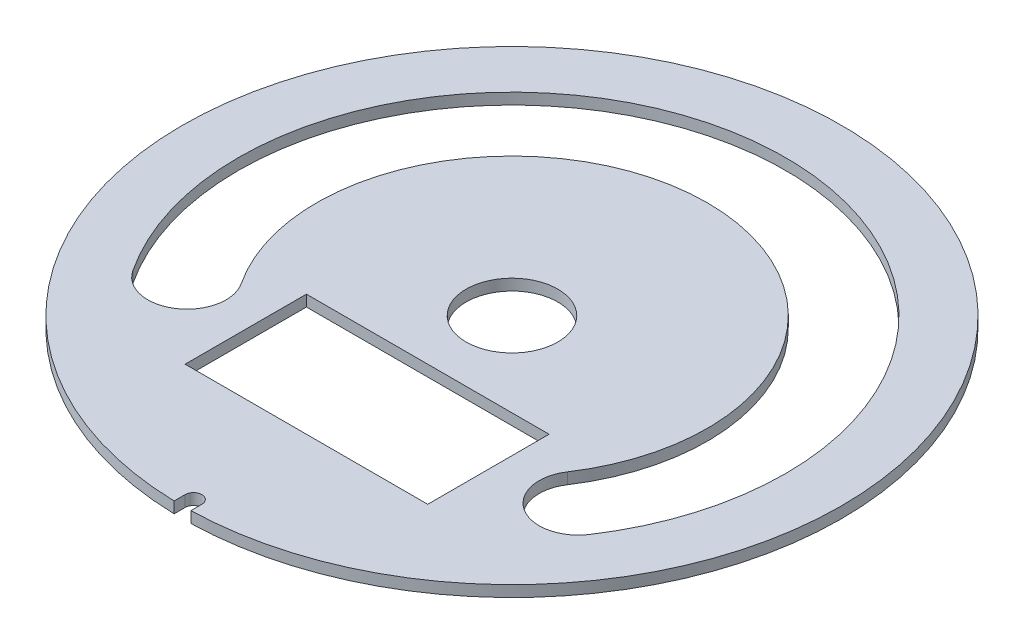
ISO-10303-21;
HEADER;
FILE_DESCRIPTION(('STEP AP214'),'2;1');
FILE_NAME('part.step','',(''),(''),'','','');
FILE_SCHEMA(('AUTOMOTIVE_DESIGN { 1 0 10303 214 1 1 1 1 }'));
ENDSEC;
DATA;
#1=APPLICATION_CONTEXT('core data for automotive mechanical design processes');
#2=APPLICATION_PROTOCOL_DEFINITION('international standard','automotive_design',2000,#1);
#3=PRODUCT_CONTEXT('',#1,'mechanical');
#4=PRODUCT('Part','Part','',(#3));
#5=PRODUCT_RELATED_PRODUCT_CATEGORY('part','',(#4));
#6=PRODUCT_DEFINITION_FORMATION('','',#4);
#7=PRODUCT_DEFINITION_CONTEXT('part definition',#1,'design');
#8=PRODUCT_DEFINITION('design','',#6,#7);
#9=PRODUCT_DEFINITION_SHAPE('','',#8);
#10=(LENGTH_UNIT() NAMED_UNIT(*) SI_UNIT(.MILLI.,.METRE.));
#11=(NAMED_UNIT(*) PLANE_ANGLE_UNIT() SI_UNIT($,.RADIAN.));
#12=(NAMED_UNIT(*) SI_UNIT($,.STERADIAN.) SOLID_ANGLE_UNIT());
#13=UNCERTAINTY_MEASURE_WITH_UNIT(LENGTH_MEASURE(1.E-05),#10,'distance_accuracy_value','');
#14=(GEOMETRIC_REPRESENTATION_CONTEXT(3) GLOBAL_UNCERTAINTY_ASSIGNED_CONTEXT((#13)) GLOBAL_UNIT_ASSIGNED_CONTEXT((#10,
#11,#12)) REPRESENTATION_CONTEXT('',''));
#15=CARTESIAN_POINT('',(0.,0.,0.));
#16=DIRECTION('',(0.,0.,1.));
#17=DIRECTION('',(1.,0.,0.));
#18=AXIS2_PLACEMENT_3D('',#15,#16,#17);
#19=CARTESIAN_POINT('',(0.,1.,0.));
#20=DIRECTION('',(0.,1.,0.));
#21=DIRECTION('',(0.,0.,1.));
#22=AXIS2_PLACEMENT_3D('',#19,#20,#21);
#23=PLANE('',#22);
#24=CARTESIAN_POINT('',(0.,1.,0.));
#25=DIRECTION('',(0.,1.,0.));
#26=DIRECTION('',(0.,0.,1.));
#27=AXIS2_PLACEMENT_3D('',#24,#25,#26);
#28=CIRCLE('',#27,29.475);
#29=CARTESIAN_POINT('',(0.750000000000004,1.,29.4654564702466));
#30=VERTEX_POINT('',#29);
#31=CARTESIAN_POINT('',(-0.75,1.,29.4654564702466));
#32=VERTEX_POINT('',#31);
#33=EDGE_CURVE('E194',#30,#32,#28,.T.);
#34=ORIENTED_EDGE('',*,*,#33,.T.);
#35=DIRECTION('',(0.,0.,-1.));
#36=VECTOR('',#35,1.);
#37=CARTESIAN_POINT('',(-0.75,1.,28.5036543648094));
#38=LINE('',#37,#36);
#39=CARTESIAN_POINT('',(-0.75,1.,28.5036543648094));
#40=VERTEX_POINT('',#39);
#41=EDGE_CURVE('E197',#32,#40,#38,.T.);
#42=ORIENTED_EDGE('',*,*,#41,.T.);
#43=CARTESIAN_POINT('',(0.,1.,28.4824849110271));
#44=DIRECTION('',(0.,-1.,0.));
#45=DIRECTION('',(0.,0.,1.));
#46=AXIS2_PLACEMENT_3D('',#43,#44,#45);
#47=CIRCLE('',#46,0.750298704366094);
#48=CARTESIAN_POINT('',(0.75,1.,28.5036543648094));
#49=VERTEX_POINT('',#48);
#50=EDGE_CURVE('E200',#40,#49,#47,.T.);
#51=ORIENTED_EDGE('',*,*,#50,.T.);
#52=DIRECTION('',(0.,0.,1.));
#53=VECTOR('',#52,1.);
#54=CARTESIAN_POINT('',(0.75,1.,28.5036543648094));
#55=LINE('',#54,#53);
#56=EDGE_CURVE('E202',#49,#30,#55,.T.);
#57=ORIENTED_EDGE('',*,*,#56,.T.);
#58=EDGE_LOOP('',(#34,#42,#51,#57));
#59=FACE_BOUND('',#58,.T.);
#60=CARTESIAN_POINT('',(0.,1.,0.));
#61=DIRECTION('',(0.,1.,0.));
#62=DIRECTION('',(0.,0.,1.));
#63=AXIS2_PLACEMENT_3D('',#60,#61,#62);
#64=CIRCLE('',#63,4.1);
#65=CARTESIAN_POINT('',(0.,1.,4.1));
#66=VERTEX_POINT('',#65);
#67=EDGE_CURVE('E188',#66,#66,#64,.T.);
#68=ORIENTED_EDGE('',*,*,#67,.F.);
#69=EDGE_LOOP('',(#68));
#70=FACE_BOUND('',#69,.T.);
#71=DIRECTION('',(-1.,0.,0.));
#72=VECTOR('',#71,1.);
#73=CARTESIAN_POINT('',(-10.85,1.,7.53248491102715));
#74=LINE('',#73,#72);
#75=CARTESIAN_POINT('',(10.85,1.,7.53248491102715));
#76=VERTEX_POINT('',#75);
#77=CARTESIAN_POINT('',(-10.85,1.,7.53248491102715));
#78=VERTEX_POINT('',#77);
#79=EDGE_CURVE('E159',#76,#78,#74,.T.);
#80=ORIENTED_EDGE('',*,*,#79,.F.);
#81=DIRECTION('',(0.,0.,-1.));
#82=VECTOR('',#81,1.);
#83=CARTESIAN_POINT('',(10.85,1.,18.3824849110271));
#84=LINE('',#83,#82);
#85=CARTESIAN_POINT('',(10.85,1.,18.3824849110271));
#86=VERTEX_POINT('',#85);
#87=EDGE_CURVE('E157',#86,#76,#84,.T.);
#88=ORIENTED_EDGE('',*,*,#87,.F.);
#89=DIRECTION('',(1.,0.,0.));
#90=VECTOR('',#89,1.);
#91=CARTESIAN_POINT('',(-10.85,1.,18.3824849110271));
#92=LINE('',#91,#90);
#93=CARTESIAN_POINT('',(-10.85,1.,18.3824849110271));
#94=VERTEX_POINT('',#93);
#95=EDGE_CURVE('E165',#94,#86,#92,.T.);
#96=ORIENTED_EDGE('',*,*,#95,.F.);
#97=DIRECTION('',(0.,0.,1.));
#98=VECTOR('',#97,1.);
#99=CARTESIAN_POINT('',(-10.85,1.,18.3824849110271));
#100=LINE('',#99,#98);
#101=EDGE_CURVE('E162',#78,#94,#100,.T.);
#102=ORIENTED_EDGE('',*,*,#101,.F.);
#103=EDGE_LOOP('',(#80,#88,#96,#102));
#104=FACE_BOUND('',#103,.T.);
#105=CARTESIAN_POINT('',(0.,1.,0.));
#106=DIRECTION('',(0.,1.,0.));
#107=DIRECTION('',(0.,0.,1.));
#108=AXIS2_PLACEMENT_3D('',#105,#106,#107);
#109=CIRCLE('',#108,24.475);
#110=CARTESIAN_POINT('',(20.4201430274136,1.,13.4923453758037));
#111=VERTEX_POINT('',#110);
#112=CARTESIAN_POINT('',(-20.4201430274136,1.,13.4923453758037));
#113=VERTEX_POINT('',#112);
#114=EDGE_CURVE('E129',#111,#113,#109,.T.);
#115=ORIENTED_EDGE('',*,*,#114,.F.);
#116=CARTESIAN_POINT('',(17.5,1.,11.5628986417766));
#117=DIRECTION('',(0.,1.,0.));
#118=DIRECTION('',(0.,0.,1.));
#119=AXIS2_PLACEMENT_3D('',#116,#117,#118);
#120=CIRCLE('',#119,3.5);
#121=CARTESIAN_POINT('',(14.5798569725864,1.,9.63345190774955));
#122=VERTEX_POINT('',#121);
#123=EDGE_CURVE('E121',#122,#111,#120,.T.);
#124=ORIENTED_EDGE('',*,*,#123,.F.);
#125=CARTESIAN_POINT('',(0.,1.,0.));
#126=DIRECTION('',(0.,-1.,0.));
#127=DIRECTION('',(0.,0.,1.));
#128=AXIS2_PLACEMENT_3D('',#125,#126,#127);
#129=CIRCLE('',#128,17.475);
#130=CARTESIAN_POINT('',(-14.5798569725864,1.,9.63345190774955));
#131=VERTEX_POINT('',#130);
#132=EDGE_CURVE('E143',#131,#122,#129,.T.);
#133=ORIENTED_EDGE('',*,*,#132,.F.);
#134=CARTESIAN_POINT('',(-17.5,1.,11.5628986417766));
#135=DIRECTION('',(0.,1.,0.));
#136=DIRECTION('',(0.,0.,1.));
#137=AXIS2_PLACEMENT_3D('',#134,#135,#136);
#138=CIRCLE('',#137,3.5);
#139=EDGE_CURVE('E141',#113,#131,#138,.T.);
#140=ORIENTED_EDGE('',*,*,#139,.F.);
#141=EDGE_LOOP('',(#115,#124,#133,#140));
#142=FACE_BOUND('',#141,.T.);
#143=ADVANCED_FACE('F32',(#59,#70,#104,#142),#23,.T.);
#144=CARTESIAN_POINT('',(0.,0.,0.));
#145=DIRECTION('',(0.,1.,0.));
#146=DIRECTION('',(0.,0.,1.));
#147=AXIS2_PLACEMENT_3D('',#144,#145,#146);
#148=PLANE('',#147);
#149=DIRECTION('',(0.,0.,-1.));
#150=VECTOR('',#149,1.);
#151=CARTESIAN_POINT('',(10.85,0.,18.3824849110271));
#152=LINE('',#151,#150);
#153=CARTESIAN_POINT('',(10.85,0.,18.3824849110271));
#154=VERTEX_POINT('',#153);
#155=CARTESIAN_POINT('',(10.85,0.,7.53248491102715));
#156=VERTEX_POINT('',#155);
#157=EDGE_CURVE('E137',#154,#156,#152,.T.);
#158=ORIENTED_EDGE('',*,*,#157,.T.);
#159=DIRECTION('',(-1.,0.,0.));
#160=VECTOR('',#159,1.);
#161=CARTESIAN_POINT('',(-10.85,0.,7.53248491102715));
#162=LINE('',#161,#160);
#163=CARTESIAN_POINT('',(-10.85,0.,7.53248491102715));
#164=VERTEX_POINT('',#163);
#165=EDGE_CURVE('E170',#156,#164,#162,.T.);
#166=ORIENTED_EDGE('',*,*,#165,.T.);
#167=DIRECTION('',(0.,0.,1.));
#168=VECTOR('',#167,1.);
#169=CARTESIAN_POINT('',(-10.85,0.,18.3824849110271));
#170=LINE('',#169,#168);
#171=CARTESIAN_POINT('',(-10.85,0.,18.3824849110271));
#172=VERTEX_POINT('',#171);
#173=EDGE_CURVE('E173',#164,#172,#170,.T.);
#174=ORIENTED_EDGE('',*,*,#173,.T.);
#175=DIRECTION('',(1.,0.,0.));
#176=VECTOR('',#175,1.);
#177=CARTESIAN_POINT('',(-10.85,0.,18.3824849110271));
#178=LINE('',#177,#176);
#179=EDGE_CURVE('E160',#172,#154,#178,.T.);
#180=ORIENTED_EDGE('',*,*,#179,.T.);
#181=EDGE_LOOP('',(#158,#166,#174,#180));
#182=FACE_BOUND('',#181,.T.);
#183=CARTESIAN_POINT('',(0.,0.,0.));
#184=DIRECTION('',(0.,1.,0.));
#185=DIRECTION('',(0.,0.,1.));
#186=AXIS2_PLACEMENT_3D('',#183,#184,#185);
#187=CIRCLE('',#186,29.475);
#188=CARTESIAN_POINT('',(0.750000000000004,0.,29.4654564702466));
#189=VERTEX_POINT('',#188);
#190=CARTESIAN_POINT('',(-0.75,0.,29.4654564702466));
#191=VERTEX_POINT('',#190);
#192=EDGE_CURVE('E191',#189,#191,#187,.T.);
#193=ORIENTED_EDGE('',*,*,#192,.F.);
#194=DIRECTION('',(0.,0.,1.));
#195=VECTOR('',#194,1.);
#196=CARTESIAN_POINT('',(0.75,0.,28.5036543648094));
#197=LINE('',#196,#195);
#198=CARTESIAN_POINT('',(0.75,0.,28.5036543648094));
#199=VERTEX_POINT('',#198);
#200=EDGE_CURVE('E198',#199,#189,#197,.T.);
#201=ORIENTED_EDGE('',*,*,#200,.F.);
#202=CARTESIAN_POINT('',(0.,0.,28.4824849110271));
#203=DIRECTION('',(0.,-1.,0.));
#204=DIRECTION('',(0.,0.,1.));
#205=AXIS2_PLACEMENT_3D('',#202,#203,#204);
#206=CIRCLE('',#205,0.750298704366094);
#207=CARTESIAN_POINT('',(-0.75,0.,28.5036543648094));
#208=VERTEX_POINT('',#207);
#209=EDGE_CURVE('E209',#208,#199,#206,.T.);
#210=ORIENTED_EDGE('',*,*,#209,.F.);
#211=DIRECTION('',(0.,0.,-1.));
#212=VECTOR('',#211,1.);
#213=CARTESIAN_POINT('',(-0.75,0.,28.5036543648094));
#214=LINE('',#213,#212);
#215=EDGE_CURVE('E207',#191,#208,#214,.T.);
#216=ORIENTED_EDGE('',*,*,#215,.F.);
#217=EDGE_LOOP('',(#193,#201,#210,#216));
#218=FACE_BOUND('',#217,.T.);
#219=CARTESIAN_POINT('',(0.,0.,0.));
#220=DIRECTION('',(0.,1.,0.));
#221=DIRECTION('',(0.,0.,1.));
#222=AXIS2_PLACEMENT_3D('',#219,#220,#221);
#223=CIRCLE('',#222,4.1);
#224=CARTESIAN_POINT('',(0.,0.,4.1));
#225=VERTEX_POINT('',#224);
#226=EDGE_CURVE('E187',#225,#225,#223,.T.);
#227=ORIENTED_EDGE('',*,*,#226,.T.);
#228=EDGE_LOOP('',(#227));
#229=FACE_BOUND('',#228,.T.);
#230=CARTESIAN_POINT('',(17.5,0.,11.5628986417766));
#231=DIRECTION('',(0.,1.,0.));
#232=DIRECTION('',(0.,0.,1.));
#233=AXIS2_PLACEMENT_3D('',#230,#231,#232);
#234=CIRCLE('',#233,3.5);
#235=CARTESIAN_POINT('',(14.5798569725864,0.,9.63345190774955));
#236=VERTEX_POINT('',#235);
#237=CARTESIAN_POINT('',(20.4201430274136,0.,13.4923453758037));
#238=VERTEX_POINT('',#237);
#239=EDGE_CURVE('E55',#236,#238,#234,.T.);
#240=ORIENTED_EDGE('',*,*,#239,.T.);
#241=CARTESIAN_POINT('',(0.,0.,0.));
#242=DIRECTION('',(0.,1.,0.));
#243=DIRECTION('',(0.,0.,1.));
#244=AXIS2_PLACEMENT_3D('',#241,#242,#243);
#245=CIRCLE('',#244,24.475);
#246=CARTESIAN_POINT('',(-20.4201430274136,0.,13.4923453758037));
#247=VERTEX_POINT('',#246);
#248=EDGE_CURVE('E136',#238,#247,#245,.T.);
#249=ORIENTED_EDGE('',*,*,#248,.T.);
#250=CARTESIAN_POINT('',(-17.5,0.,11.5628986417766));
#251=DIRECTION('',(0.,1.,0.));
#252=DIRECTION('',(0.,0.,1.));
#253=AXIS2_PLACEMENT_3D('',#250,#251,#252);
#254=CIRCLE('',#253,3.5);
#255=CARTESIAN_POINT('',(-14.5798569725864,0.,9.63345190774955));
#256=VERTEX_POINT('',#255);
#257=EDGE_CURVE('E149',#247,#256,#254,.T.);
#258=ORIENTED_EDGE('',*,*,#257,.T.);
#259=CARTESIAN_POINT('',(0.,0.,0.));
#260=DIRECTION('',(0.,-1.,0.));
#261=DIRECTION('',(0.,0.,1.));
#262=AXIS2_PLACEMENT_3D('',#259,#260,#261);
#263=CIRCLE('',#262,17.475);
#264=EDGE_CURVE('E130',#256,#236,#263,.T.);
#265=ORIENTED_EDGE('',*,*,#264,.T.);
#266=EDGE_LOOP('',(#240,#249,#258,#265));
#267=FACE_BOUND('',#266,.T.);
#268=ADVANCED_FACE('F227',(#182,#218,#229,#267),#148,.F.);
#269=CARTESIAN_POINT('',(0.,1.,0.));
#270=DIRECTION('',(0.,-1.,0.));
#271=DIRECTION('',(0.,0.,-1.));
#272=AXIS2_PLACEMENT_3D('',#269,#270,#271);
#273=CYLINDRICAL_SURFACE('',#272,29.475);
#274=ORIENTED_EDGE('',*,*,#192,.T.);
#275=DIRECTION('',(0.,-1.,0.));
#276=VECTOR('',#275,1.);
#277=CARTESIAN_POINT('',(-0.75,1.,29.4654564702466));
#278=LINE('',#277,#276);
#279=EDGE_CURVE('E11',#32,#191,#278,.T.);
#280=ORIENTED_EDGE('',*,*,#279,.F.);
#281=ORIENTED_EDGE('',*,*,#33,.F.);
#282=DIRECTION('',(0.,-1.,0.));
#283=VECTOR('',#282,1.);
#284=CARTESIAN_POINT('',(0.750000000000004,1.,29.4654564702466));
#285=LINE('',#284,#283);
#286=EDGE_CURVE('E204',#30,#189,#285,.T.);
#287=ORIENTED_EDGE('',*,*,#286,.T.);
#288=EDGE_LOOP('',(#274,#280,#281,#287));
#289=FACE_BOUND('',#288,.T.);
#290=ADVANCED_FACE('F34',(#289),#273,.T.);
#291=CARTESIAN_POINT('',(-0.75,1.,28.5036543648094));
#292=DIRECTION('',(-1.,0.,0.));
#293=DIRECTION('',(0.,0.,1.));
#294=AXIS2_PLACEMENT_3D('',#291,#292,#293);
#295=PLANE('',#294);
#296=ORIENTED_EDGE('',*,*,#215,.T.);
#297=DIRECTION('',(0.,-1.,0.));
#298=VECTOR('',#297,1.);
#299=CARTESIAN_POINT('',(-0.75,1.,28.5036543648094));
#300=LINE('',#299,#298);
#301=EDGE_CURVE('E40',#40,#208,#300,.T.);
#302=ORIENTED_EDGE('',*,*,#301,.F.);
#303=ORIENTED_EDGE('',*,*,#41,.F.);
#304=ORIENTED_EDGE('',*,*,#279,.T.);
#305=EDGE_LOOP('',(#296,#302,#303,#304));
#306=FACE_BOUND('',#305,.T.);
#307=ADVANCED_FACE('F238',(#306),#295,.F.);
#308=CARTESIAN_POINT('',(0.,1.,28.4824849110271));
#309=DIRECTION('',(0.,-1.,0.));
#310=DIRECTION('',(0.,0.,-1.));
#311=AXIS2_PLACEMENT_3D('',#308,#309,#310);
#312=CYLINDRICAL_SURFACE('',#311,0.750298704366094);
#313=ORIENTED_EDGE('',*,*,#209,.T.);
#314=DIRECTION('',(0.,-1.,0.));
#315=VECTOR('',#314,1.);
#316=CARTESIAN_POINT('',(0.75,1.,28.5036543648094));
#317=LINE('',#316,#315);
#318=EDGE_CURVE('E214',#49,#199,#317,.T.);
#319=ORIENTED_EDGE('',*,*,#318,.F.);
#320=ORIENTED_EDGE('',*,*,#50,.F.);
#321=ORIENTED_EDGE('',*,*,#301,.T.);
#322=EDGE_LOOP('',(#313,#319,#320,#321));
#323=FACE_BOUND('',#322,.T.);
#324=ADVANCED_FACE('F221',(#323),#312,.F.);
#325=CARTESIAN_POINT('',(0.75,1.,28.5036543648094));
#326=DIRECTION('',(1.,0.,0.));
#327=DIRECTION('',(0.,0.,-1.));
#328=AXIS2_PLACEMENT_3D('',#325,#326,#327);
#329=PLANE('',#328);
#330=ORIENTED_EDGE('',*,*,#200,.T.);
#331=ORIENTED_EDGE('',*,*,#286,.F.);
#332=ORIENTED_EDGE('',*,*,#56,.F.);
#333=ORIENTED_EDGE('',*,*,#318,.T.);
#334=EDGE_LOOP('',(#330,#331,#332,#333));
#335=FACE_BOUND('',#334,.T.);
#336=ADVANCED_FACE('F231',(#335),#329,.F.);
#337=CARTESIAN_POINT('',(0.,1.,0.));
#338=DIRECTION('',(0.,-1.,0.));
#339=DIRECTION('',(0.,0.,-1.));
#340=AXIS2_PLACEMENT_3D('',#337,#338,#339);
#341=CYLINDRICAL_SURFACE('',#340,4.1);
#342=ORIENTED_EDGE('',*,*,#67,.T.);
#343=EDGE_LOOP('',(#342));
#344=FACE_BOUND('',#343,.T.);
#345=ORIENTED_EDGE('',*,*,#226,.F.);
#346=EDGE_LOOP('',(#345));
#347=FACE_BOUND('',#346,.T.);
#348=ADVANCED_FACE('F253',(#344,#347),#341,.F.);
#349=CARTESIAN_POINT('',(10.85,1.,18.3824849110271));
#350=DIRECTION('',(-1.,0.,0.));
#351=DIRECTION('',(0.,0.,1.));
#352=AXIS2_PLACEMENT_3D('',#349,#350,#351);
#353=PLANE('',#352);
#354=ORIENTED_EDGE('',*,*,#157,.F.);
#355=DIRECTION('',(0.,-1.,0.));
#356=VECTOR('',#355,1.);
#357=CARTESIAN_POINT('',(10.85,1.,18.3824849110271));
#358=LINE('',#357,#356);
#359=EDGE_CURVE('E167',#86,#154,#358,.T.);
#360=ORIENTED_EDGE('',*,*,#359,.F.);
#361=ORIENTED_EDGE('',*,*,#87,.T.);
#362=DIRECTION('',(0.,-1.,0.));
#363=VECTOR('',#362,1.);
#364=CARTESIAN_POINT('',(10.85,1.,7.53248491102715));
#365=LINE('',#364,#363);
#366=EDGE_CURVE('E184',#76,#156,#365,.T.);
#367=ORIENTED_EDGE('',*,*,#366,.T.);
#368=EDGE_LOOP('',(#354,#360,#361,#367));
#369=FACE_BOUND('',#368,.T.);
#370=ADVANCED_FACE('F260',(#369),#353,.T.);
#371=CARTESIAN_POINT('',(-10.85,1.,7.53248491102715));
#372=DIRECTION('',(0.,0.,1.));
#373=DIRECTION('',(1.,0.,0.));
#374=AXIS2_PLACEMENT_3D('',#371,#372,#373);
#375=PLANE('',#374);
#376=ORIENTED_EDGE('',*,*,#165,.F.);
#377=ORIENTED_EDGE('',*,*,#366,.F.);
#378=ORIENTED_EDGE('',*,*,#79,.T.);
#379=DIRECTION('',(0.,-1.,0.));
#380=VECTOR('',#379,1.);
#381=CARTESIAN_POINT('',(-10.85,1.,7.53248491102715));
#382=LINE('',#381,#380);
#383=EDGE_CURVE('E182',#78,#164,#382,.T.);
#384=ORIENTED_EDGE('',*,*,#383,.T.);
#385=EDGE_LOOP('',(#376,#377,#378,#384));
#386=FACE_BOUND('',#385,.T.);
#387=ADVANCED_FACE('F265',(#386),#375,.T.);
#388=CARTESIAN_POINT('',(-10.85,1.,18.3824849110271));
#389=DIRECTION('',(1.,0.,0.));
#390=DIRECTION('',(0.,0.,-1.));
#391=AXIS2_PLACEMENT_3D('',#388,#389,#390);
#392=PLANE('',#391);
#393=ORIENTED_EDGE('',*,*,#173,.F.);
#394=ORIENTED_EDGE('',*,*,#383,.F.);
#395=ORIENTED_EDGE('',*,*,#101,.T.);
#396=DIRECTION('',(0.,-1.,0.));
#397=VECTOR('',#396,1.);
#398=CARTESIAN_POINT('',(-10.85,1.,18.3824849110271));
#399=LINE('',#398,#397);
#400=EDGE_CURVE('E180',#94,#172,#399,.T.);
#401=ORIENTED_EDGE('',*,*,#400,.T.);
#402=EDGE_LOOP('',(#393,#394,#395,#401));
#403=FACE_BOUND('',#402,.T.);
#404=ADVANCED_FACE('F289',(#403),#392,.T.);
#405=CARTESIAN_POINT('',(-10.85,1.,18.3824849110271));
#406=DIRECTION('',(0.,0.,-1.));
#407=DIRECTION('',(-1.,0.,0.));
#408=AXIS2_PLACEMENT_3D('',#405,#406,#407);
#409=PLANE('',#408);
#410=ORIENTED_EDGE('',*,*,#179,.F.);
#411=ORIENTED_EDGE('',*,*,#400,.F.);
#412=ORIENTED_EDGE('',*,*,#95,.T.);
#413=ORIENTED_EDGE('',*,*,#359,.T.);
#414=EDGE_LOOP('',(#410,#411,#412,#413));
#415=FACE_BOUND('',#414,.T.);
#416=ADVANCED_FACE('F286',(#415),#409,.T.);
#417=CARTESIAN_POINT('',(17.5,1.,11.5628986417766));
#418=DIRECTION('',(0.,-1.,0.));
#419=DIRECTION('',(0.,0.,-1.));
#420=AXIS2_PLACEMENT_3D('',#417,#418,#419);
#421=CYLINDRICAL_SURFACE('',#420,3.5);
#422=ORIENTED_EDGE('',*,*,#239,.F.);
#423=DIRECTION('',(0.,-1.,0.));
#424=VECTOR('',#423,1.);
#425=CARTESIAN_POINT('',(14.5798569725864,1.,9.63345190774955));
#426=LINE('',#425,#424);
#427=EDGE_CURVE('E125',#122,#236,#426,.T.);
#428=ORIENTED_EDGE('',*,*,#427,.F.);
#429=ORIENTED_EDGE('',*,*,#123,.T.);
#430=DIRECTION('',(0.,-1.,0.));
#431=VECTOR('',#430,1.);
#432=CARTESIAN_POINT('',(20.4201430274136,1.,13.4923453758037));
#433=LINE('',#432,#431);
#434=EDGE_CURVE('E124',#111,#238,#433,.T.);
#435=ORIENTED_EDGE('',*,*,#434,.T.);
#436=EDGE_LOOP('',(#422,#428,#429,#435));
#437=FACE_BOUND('',#436,.T.);
#438=ADVANCED_FACE('F123',(#437),#421,.F.);
#439=CARTESIAN_POINT('',(0.,1.,0.));
#440=DIRECTION('',(0.,-1.,0.));
#441=DIRECTION('',(0.,0.,-1.));
#442=AXIS2_PLACEMENT_3D('',#439,#440,#441);
#443=CYLINDRICAL_SURFACE('',#442,24.475);
#444=ORIENTED_EDGE('',*,*,#248,.F.);
#445=ORIENTED_EDGE('',*,*,#434,.F.);
#446=ORIENTED_EDGE('',*,*,#114,.T.);
#447=DIRECTION('',(0.,-1.,0.));
#448=VECTOR('',#447,1.);
#449=CARTESIAN_POINT('',(-20.4201430274136,1.,13.4923453758037));
#450=LINE('',#449,#448);
#451=EDGE_CURVE('E138',#113,#247,#450,.T.);
#452=ORIENTED_EDGE('',*,*,#451,.T.);
#453=EDGE_LOOP('',(#444,#445,#446,#452));
#454=FACE_BOUND('',#453,.T.);
#455=ADVANCED_FACE('F133',(#454),#443,.F.);
#456=CARTESIAN_POINT('',(-17.5,1.,11.5628986417766));
#457=DIRECTION('',(0.,-1.,0.));
#458=DIRECTION('',(0.,0.,-1.));
#459=AXIS2_PLACEMENT_3D('',#456,#457,#458);
#460=CYLINDRICAL_SURFACE('',#459,3.5);
#461=ORIENTED_EDGE('',*,*,#257,.F.);
#462=ORIENTED_EDGE('',*,*,#451,.F.);
#463=ORIENTED_EDGE('',*,*,#139,.T.);
#464=DIRECTION('',(0.,-1.,0.));
#465=VECTOR('',#464,1.);
#466=CARTESIAN_POINT('',(-14.5798569725864,1.,9.63345190774955));
#467=LINE('',#466,#465);
#468=EDGE_CURVE('E47',#131,#256,#467,.T.);
#469=ORIENTED_EDGE('',*,*,#468,.T.);
#470=EDGE_LOOP('',(#461,#462,#463,#469));
#471=FACE_BOUND('',#470,.T.);
#472=ADVANCED_FACE('F274',(#471),#460,.F.);
#473=CARTESIAN_POINT('',(0.,1.,0.));
#474=DIRECTION('',(0.,-1.,0.));
#475=DIRECTION('',(0.,0.,-1.));
#476=AXIS2_PLACEMENT_3D('',#473,#474,#475);
#477=CYLINDRICAL_SURFACE('',#476,17.475);
#478=ORIENTED_EDGE('',*,*,#264,.F.);
#479=ORIENTED_EDGE('',*,*,#468,.F.);
#480=ORIENTED_EDGE('',*,*,#132,.T.);
#481=ORIENTED_EDGE('',*,*,#427,.T.);
#482=EDGE_LOOP('',(#478,#479,#480,#481));
#483=FACE_BOUND('',#482,.T.);
#484=ADVANCED_FACE('F272',(#483),#477,.T.);
#485=CLOSED_SHELL('',(#143,#268,#290,#307,#324,#336,#348,#370,#387,#404,#416,#438,#455,#472,#484));
#486=MANIFOLD_SOLID_BREP('B2',#485);
#487=ADVANCED_BREP_SHAPE_REPRESENTATION('',(#18,#486),#14);
#488=SHAPE_DEFINITION_REPRESENTATION(#9,#487);
ENDSEC;
END-ISO-10303-21;
